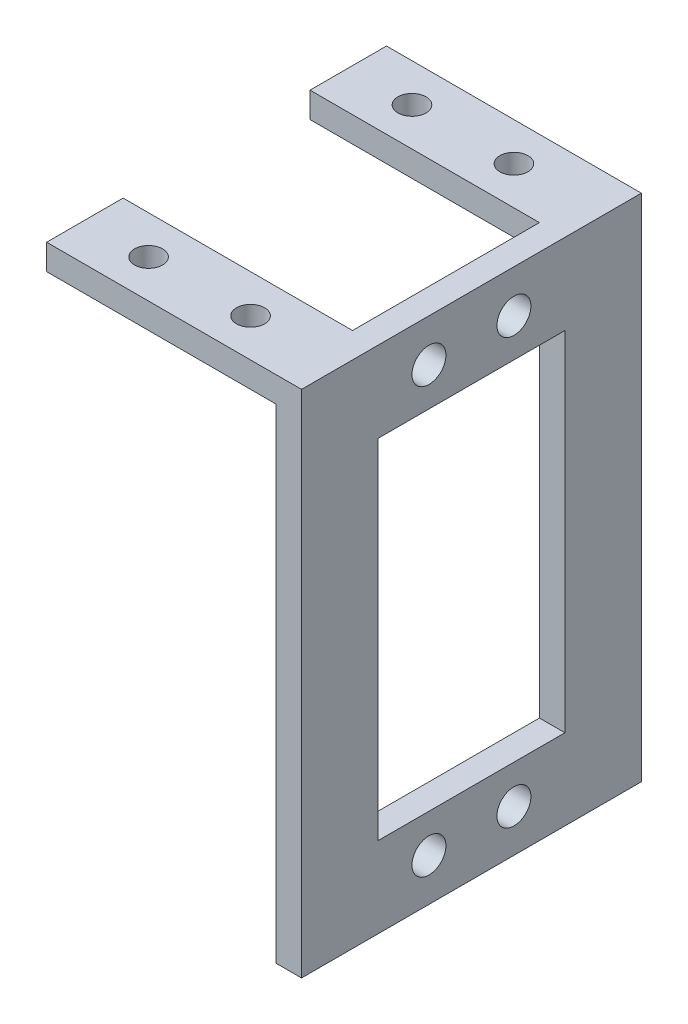
ISO-10303-21;
HEADER;
FILE_DESCRIPTION(('STEP AP214'),'2;1');
FILE_NAME('part.step','',(''),(''),'','','');
FILE_SCHEMA(('AUTOMOTIVE_DESIGN { 1 0 10303 214 1 1 1 1 }'));
ENDSEC;
DATA;
#1=APPLICATION_CONTEXT('core data for automotive mechanical design processes');
#2=APPLICATION_PROTOCOL_DEFINITION('international standard','automotive_design',2000,#1);
#3=PRODUCT_CONTEXT('',#1,'mechanical');
#4=PRODUCT('Part','Part','',(#3));
#5=PRODUCT_RELATED_PRODUCT_CATEGORY('part','',(#4));
#6=PRODUCT_DEFINITION_FORMATION('','',#4);
#7=PRODUCT_DEFINITION_CONTEXT('part definition',#1,'design');
#8=PRODUCT_DEFINITION('design','',#6,#7);
#9=PRODUCT_DEFINITION_SHAPE('','',#8);
#10=(LENGTH_UNIT() NAMED_UNIT(*) SI_UNIT(.MILLI.,.METRE.));
#11=(NAMED_UNIT(*) PLANE_ANGLE_UNIT() SI_UNIT($,.RADIAN.));
#12=(NAMED_UNIT(*) SI_UNIT($,.STERADIAN.) SOLID_ANGLE_UNIT());
#13=UNCERTAINTY_MEASURE_WITH_UNIT(LENGTH_MEASURE(1.E-05),#10,'distance_accuracy_value','');
#14=(GEOMETRIC_REPRESENTATION_CONTEXT(3) GLOBAL_UNCERTAINTY_ASSIGNED_CONTEXT((#13)) GLOBAL_UNIT_ASSIGNED_CONTEXT((#10,
#11,#12)) REPRESENTATION_CONTEXT('',''));
#15=CARTESIAN_POINT('',(0.,0.,0.));
#16=DIRECTION('',(0.,0.,1.));
#17=DIRECTION('',(1.,0.,0.));
#18=AXIS2_PLACEMENT_3D('',#15,#16,#17);
#19=CARTESIAN_POINT('',(0.,0.,40.));
#20=DIRECTION('',(1.,0.,0.));
#21=DIRECTION('',(0.,0.,-1.));
#22=AXIS2_PLACEMENT_3D('',#19,#20,#21);
#23=PLANE('',#22);
#24=DIRECTION('',(0.,0.,-1.));
#25=VECTOR('',#24,1.);
#26=CARTESIAN_POINT('',(0.,-3.,40.));
#27=LINE('',#26,#25);
#28=CARTESIAN_POINT('',(0.,-3.,9.));
#29=VERTEX_POINT('',#28);
#30=CARTESIAN_POINT('',(0.,-3.,0.));
#31=VERTEX_POINT('',#30);
#32=EDGE_CURVE('E46',#29,#31,#27,.T.);
#33=ORIENTED_EDGE('',*,*,#32,.F.);
#34=DIRECTION('',(0.,1.,0.));
#35=VECTOR('',#34,1.);
#36=CARTESIAN_POINT('',(0.,-10.,9.));
#37=LINE('',#36,#35);
#38=CARTESIAN_POINT('',(0.,0.,9.));
#39=VERTEX_POINT('',#38);
#40=EDGE_CURVE('E219',#29,#39,#37,.T.);
#41=ORIENTED_EDGE('',*,*,#40,.T.);
#42=DIRECTION('',(0.,0.,-1.));
#43=VECTOR('',#42,1.);
#44=CARTESIAN_POINT('',(0.,0.,40.));
#45=LINE('',#44,#43);
#46=CARTESIAN_POINT('',(0.,0.,0.));
#47=VERTEX_POINT('',#46);
#48=EDGE_CURVE('E260',#39,#47,#45,.T.);
#49=ORIENTED_EDGE('',*,*,#48,.T.);
#50=DIRECTION('',(0.,-1.,0.));
#51=VECTOR('',#50,1.);
#52=CARTESIAN_POINT('',(0.,0.,0.));
#53=LINE('',#52,#51);
#54=EDGE_CURVE('E245',#47,#31,#53,.T.);
#55=ORIENTED_EDGE('',*,*,#54,.T.);
#56=EDGE_LOOP('',(#33,#41,#49,#55));
#57=FACE_BOUND('',#56,.T.);
#58=ADVANCED_FACE('F38',(#57),#23,.F.);
#59=CARTESIAN_POINT('',(0.,-3.,40.));
#60=DIRECTION('',(0.,1.,0.));
#61=DIRECTION('',(0.,0.,1.));
#62=AXIS2_PLACEMENT_3D('',#59,#60,#61);
#63=PLANE('',#62);
#64=CARTESIAN_POINT('',(19.5,-3.,4.5));
#65=DIRECTION('',(0.,1.,0.));
#66=DIRECTION('',(0.,0.,1.));
#67=AXIS2_PLACEMENT_3D('',#64,#65,#66);
#68=CIRCLE('',#67,1.65);
#69=CARTESIAN_POINT('',(19.5,-3.,6.15));
#70=VERTEX_POINT('',#69);
#71=EDGE_CURVE('E236',#70,#70,#68,.T.);
#72=ORIENTED_EDGE('',*,*,#71,.T.);
#73=EDGE_LOOP('',(#72));
#74=FACE_BOUND('',#73,.T.);
#75=CARTESIAN_POINT('',(7.5,-3.,4.5));
#76=DIRECTION('',(0.,1.,0.));
#77=DIRECTION('',(0.,0.,1.));
#78=AXIS2_PLACEMENT_3D('',#75,#76,#77);
#79=CIRCLE('',#78,1.65);
#80=CARTESIAN_POINT('',(7.5,-3.,6.15));
#81=VERTEX_POINT('',#80);
#82=EDGE_CURVE('E233',#81,#81,#79,.T.);
#83=ORIENTED_EDGE('',*,*,#82,.T.);
#84=EDGE_LOOP('',(#83));
#85=FACE_BOUND('',#84,.T.);
#86=DIRECTION('',(0.,0.,-1.));
#87=VECTOR('',#86,1.);
#88=CARTESIAN_POINT('',(27.,-3.,40.));
#89=LINE('',#88,#87);
#90=CARTESIAN_POINT('',(27.,-3.,9.));
#91=VERTEX_POINT('',#90);
#92=CARTESIAN_POINT('',(27.,-3.,0.));
#93=VERTEX_POINT('',#92);
#94=EDGE_CURVE('E285',#91,#93,#89,.T.);
#95=ORIENTED_EDGE('',*,*,#94,.F.);
#96=DIRECTION('',(-1.,0.,0.));
#97=VECTOR('',#96,1.);
#98=CARTESIAN_POINT('',(0.,-3.,9.));
#99=LINE('',#98,#97);
#100=EDGE_CURVE('E230',#91,#29,#99,.T.);
#101=ORIENTED_EDGE('',*,*,#100,.T.);
#102=ORIENTED_EDGE('',*,*,#32,.T.);
#103=DIRECTION('',(1.,0.,0.));
#104=VECTOR('',#103,1.);
#105=CARTESIAN_POINT('',(0.,-3.,0.));
#106=LINE('',#105,#104);
#107=EDGE_CURVE('E263',#31,#93,#106,.T.);
#108=ORIENTED_EDGE('',*,*,#107,.T.);
#109=EDGE_LOOP('',(#95,#101,#102,#108));
#110=FACE_BOUND('',#109,.T.);
#111=ADVANCED_FACE('F298',(#74,#85,#110),#63,.F.);
#112=CARTESIAN_POINT('',(0.,0.,40.));
#113=VERTEX_POINT('',#112);
#114=CARTESIAN_POINT('',(0.,0.,31.));
#115=VERTEX_POINT('',#114);
#116=EDGE_CURVE('E274',#113,#115,#45,.T.);
#117=ORIENTED_EDGE('',*,*,#116,.T.);
#118=DIRECTION('',(0.,1.,0.));
#119=VECTOR('',#118,1.);
#120=CARTESIAN_POINT('',(0.,-10.,31.));
#121=LINE('',#120,#119);
#122=CARTESIAN_POINT('',(0.,-3.,31.));
#123=VERTEX_POINT('',#122);
#124=EDGE_CURVE('E218',#123,#115,#121,.T.);
#125=ORIENTED_EDGE('',*,*,#124,.F.);
#126=CARTESIAN_POINT('',(0.,-3.,40.));
#127=VERTEX_POINT('',#126);
#128=EDGE_CURVE('E11',#127,#123,#27,.T.);
#129=ORIENTED_EDGE('',*,*,#128,.F.);
#130=DIRECTION('',(0.,-1.,0.));
#131=VECTOR('',#130,1.);
#132=CARTESIAN_POINT('',(0.,0.,40.));
#133=LINE('',#132,#131);
#134=EDGE_CURVE('E246',#113,#127,#133,.T.);
#135=ORIENTED_EDGE('',*,*,#134,.F.);
#136=EDGE_LOOP('',(#117,#125,#129,#135));
#137=FACE_BOUND('',#136,.T.);
#138=ADVANCED_FACE('F40',(#137),#23,.F.);
#139=CARTESIAN_POINT('',(7.5,-3.,35.5));
#140=DIRECTION('',(0.,1.,0.));
#141=DIRECTION('',(0.,0.,1.));
#142=AXIS2_PLACEMENT_3D('',#139,#140,#141);
#143=CIRCLE('',#142,1.65);
#144=CARTESIAN_POINT('',(7.5,-3.,37.15));
#145=VERTEX_POINT('',#144);
#146=EDGE_CURVE('E242',#145,#145,#143,.T.);
#147=ORIENTED_EDGE('',*,*,#146,.T.);
#148=EDGE_LOOP('',(#147));
#149=FACE_BOUND('',#148,.T.);
#150=CARTESIAN_POINT('',(19.5,-3.,35.5));
#151=DIRECTION('',(0.,1.,0.));
#152=DIRECTION('',(0.,0.,1.));
#153=AXIS2_PLACEMENT_3D('',#150,#151,#152);
#154=CIRCLE('',#153,1.65);
#155=CARTESIAN_POINT('',(19.5,-3.,37.15));
#156=VERTEX_POINT('',#155);
#157=EDGE_CURVE('E239',#156,#156,#154,.T.);
#158=ORIENTED_EDGE('',*,*,#157,.T.);
#159=EDGE_LOOP('',(#158));
#160=FACE_BOUND('',#159,.T.);
#161=ORIENTED_EDGE('',*,*,#128,.T.);
#162=DIRECTION('',(1.,0.,0.));
#163=VECTOR('',#162,1.);
#164=CARTESIAN_POINT('',(0.,-3.,31.));
#165=LINE('',#164,#163);
#166=CARTESIAN_POINT('',(27.,-3.,31.));
#167=VERTEX_POINT('',#166);
#168=EDGE_CURVE('E222',#123,#167,#165,.T.);
#169=ORIENTED_EDGE('',*,*,#168,.T.);
#170=CARTESIAN_POINT('',(27.,-3.,40.));
#171=VERTEX_POINT('',#170);
#172=EDGE_CURVE('E286',#171,#167,#89,.T.);
#173=ORIENTED_EDGE('',*,*,#172,.F.);
#174=DIRECTION('',(1.,0.,0.));
#175=VECTOR('',#174,1.);
#176=CARTESIAN_POINT('',(0.,-3.,40.));
#177=LINE('',#176,#175);
#178=EDGE_CURVE('E249',#127,#171,#177,.T.);
#179=ORIENTED_EDGE('',*,*,#178,.F.);
#180=EDGE_LOOP('',(#161,#169,#173,#179));
#181=FACE_BOUND('',#180,.T.);
#182=ADVANCED_FACE('F320',(#149,#160,#181),#63,.F.);
#183=CARTESIAN_POINT('',(27.,-3.,40.));
#184=DIRECTION('',(1.,0.,0.));
#185=DIRECTION('',(0.,1.,0.));
#186=AXIS2_PLACEMENT_3D('',#183,#184,#185);
#187=PLANE('',#186);
#188=CARTESIAN_POINT('',(27.,-5.,15.));
#189=DIRECTION('',(1.,0.,0.));
#190=DIRECTION('',(0.,1.,0.));
#191=AXIS2_PLACEMENT_3D('',#188,#189,#190);
#192=CIRCLE('',#191,2.);
#193=CARTESIAN_POINT('',(27.,-3.,15.));
#194=VERTEX_POINT('',#193);
#195=EDGE_CURVE('E195',#194,#194,#192,.T.);
#196=ORIENTED_EDGE('',*,*,#195,.T.);
#197=EDGE_LOOP('',(#196));
#198=FACE_BOUND('',#197,.T.);
#199=CARTESIAN_POINT('',(27.,-55.,15.));
#200=DIRECTION('',(1.,0.,0.));
#201=DIRECTION('',(0.,1.,0.));
#202=AXIS2_PLACEMENT_3D('',#199,#200,#201);
#203=CIRCLE('',#202,2.);
#204=CARTESIAN_POINT('',(27.,-53.,15.));
#205=VERTEX_POINT('',#204);
#206=EDGE_CURVE('E192',#205,#205,#203,.T.);
#207=ORIENTED_EDGE('',*,*,#206,.T.);
#208=EDGE_LOOP('',(#207));
#209=FACE_BOUND('',#208,.T.);
#210=CARTESIAN_POINT('',(27.,-55.,25.));
#211=DIRECTION('',(1.,0.,0.));
#212=DIRECTION('',(0.,1.,0.));
#213=AXIS2_PLACEMENT_3D('',#210,#211,#212);
#214=CIRCLE('',#213,2.);
#215=CARTESIAN_POINT('',(27.,-53.,25.));
#216=VERTEX_POINT('',#215);
#217=EDGE_CURVE('E189',#216,#216,#214,.T.);
#218=ORIENTED_EDGE('',*,*,#217,.T.);
#219=EDGE_LOOP('',(#218));
#220=FACE_BOUND('',#219,.T.);
#221=DIRECTION('',(0.,0.,-1.));
#222=VECTOR('',#221,1.);
#223=CARTESIAN_POINT('',(27.,-50.5,40.));
#224=LINE('',#223,#222);
#225=CARTESIAN_POINT('',(27.,-50.5,31.));
#226=VERTEX_POINT('',#225);
#227=CARTESIAN_POINT('',(27.,-50.5,8.99999999999999));
#228=VERTEX_POINT('',#227);
#229=EDGE_CURVE('E183',#226,#228,#224,.T.);
#230=ORIENTED_EDGE('',*,*,#229,.T.);
#231=DIRECTION('',(0.,1.,0.));
#232=VECTOR('',#231,1.);
#233=CARTESIAN_POINT('',(27.,-3.,8.99999999999999));
#234=LINE('',#233,#232);
#235=CARTESIAN_POINT('',(27.,-9.50000000000001,8.99999999999999));
#236=VERTEX_POINT('',#235);
#237=EDGE_CURVE('E186',#228,#236,#234,.T.);
#238=ORIENTED_EDGE('',*,*,#237,.T.);
#239=DIRECTION('',(0.,0.,1.));
#240=VECTOR('',#239,1.);
#241=CARTESIAN_POINT('',(27.,-9.50000000000001,40.));
#242=LINE('',#241,#240);
#243=CARTESIAN_POINT('',(27.,-9.50000000000001,31.));
#244=VERTEX_POINT('',#243);
#245=EDGE_CURVE('E180',#236,#244,#242,.T.);
#246=ORIENTED_EDGE('',*,*,#245,.T.);
#247=DIRECTION('',(0.,-1.,0.));
#248=VECTOR('',#247,1.);
#249=CARTESIAN_POINT('',(27.,-3.,31.));
#250=LINE('',#249,#248);
#251=EDGE_CURVE('E145',#244,#226,#250,.T.);
#252=ORIENTED_EDGE('',*,*,#251,.T.);
#253=EDGE_LOOP('',(#230,#238,#246,#252));
#254=FACE_BOUND('',#253,.T.);
#255=CARTESIAN_POINT('',(27.,-5.,25.));
#256=DIRECTION('',(1.,0.,0.));
#257=DIRECTION('',(0.,1.,0.));
#258=AXIS2_PLACEMENT_3D('',#255,#256,#257);
#259=CIRCLE('',#258,2.);
#260=CARTESIAN_POINT('',(27.,-3.,25.));
#261=VERTEX_POINT('',#260);
#262=EDGE_CURVE('E177',#261,#261,#259,.T.);
#263=ORIENTED_EDGE('',*,*,#262,.T.);
#264=EDGE_LOOP('',(#263));
#265=FACE_BOUND('',#264,.T.);
#266=ORIENTED_EDGE('',*,*,#172,.T.);
#267=DIRECTION('',(0.,1.,0.));
#268=VECTOR('',#267,1.);
#269=CARTESIAN_POINT('',(27.,-10.,31.));
#270=LINE('',#269,#268);
#271=CARTESIAN_POINT('',(27.,0.,31.));
#272=VERTEX_POINT('',#271);
#273=EDGE_CURVE('E225',#167,#272,#270,.T.);
#274=ORIENTED_EDGE('',*,*,#273,.T.);
#275=DIRECTION('',(0.,0.,-1.));
#276=VECTOR('',#275,1.);
#277=CARTESIAN_POINT('',(27.,0.,9.));
#278=LINE('',#277,#276);
#279=CARTESIAN_POINT('',(27.,0.,9.));
#280=VERTEX_POINT('',#279);
#281=EDGE_CURVE('E213',#272,#280,#278,.T.);
#282=ORIENTED_EDGE('',*,*,#281,.T.);
#283=DIRECTION('',(0.,1.,0.));
#284=VECTOR('',#283,1.);
#285=CARTESIAN_POINT('',(27.,-10.,9.));
#286=LINE('',#285,#284);
#287=EDGE_CURVE('E223',#91,#280,#286,.T.);
#288=ORIENTED_EDGE('',*,*,#287,.F.);
#289=ORIENTED_EDGE('',*,*,#94,.T.);
#290=DIRECTION('',(0.,-1.,0.));
#291=VECTOR('',#290,1.);
#292=CARTESIAN_POINT('',(27.,-3.,0.));
#293=LINE('',#292,#291);
#294=CARTESIAN_POINT('',(27.,-60.,0.));
#295=VERTEX_POINT('',#294);
#296=EDGE_CURVE('E266',#93,#295,#293,.T.);
#297=ORIENTED_EDGE('',*,*,#296,.T.);
#298=DIRECTION('',(0.,0.,-1.));
#299=VECTOR('',#298,1.);
#300=CARTESIAN_POINT('',(27.,-60.,40.));
#301=LINE('',#300,#299);
#302=CARTESIAN_POINT('',(27.,-60.,40.));
#303=VERTEX_POINT('',#302);
#304=EDGE_CURVE('E283',#303,#295,#301,.T.);
#305=ORIENTED_EDGE('',*,*,#304,.F.);
#306=DIRECTION('',(0.,-1.,0.));
#307=VECTOR('',#306,1.);
#308=CARTESIAN_POINT('',(27.,-3.,40.));
#309=LINE('',#308,#307);
#310=EDGE_CURVE('E252',#171,#303,#309,.T.);
#311=ORIENTED_EDGE('',*,*,#310,.F.);
#312=EDGE_LOOP('',(#266,#274,#282,#288,#289,#297,#305,#311));
#313=FACE_BOUND('',#312,.T.);
#314=ADVANCED_FACE('F293',(#198,#209,#220,#254,#265,#313),#187,.F.);
#315=CARTESIAN_POINT('',(27.,-60.,40.));
#316=DIRECTION('',(0.,1.,0.));
#317=DIRECTION('',(0.,0.,1.));
#318=AXIS2_PLACEMENT_3D('',#315,#316,#317);
#319=PLANE('',#318);
#320=DIRECTION('',(1.,0.,0.));
#321=VECTOR('',#320,1.);
#322=CARTESIAN_POINT('',(27.,-60.,0.));
#323=LINE('',#322,#321);
#324=CARTESIAN_POINT('',(30.,-60.,0.));
#325=VERTEX_POINT('',#324);
#326=EDGE_CURVE('E268',#295,#325,#323,.T.);
#327=ORIENTED_EDGE('',*,*,#326,.T.);
#328=DIRECTION('',(0.,0.,-1.));
#329=VECTOR('',#328,1.);
#330=CARTESIAN_POINT('',(30.,-60.,40.));
#331=LINE('',#330,#329);
#332=CARTESIAN_POINT('',(30.,-60.,40.));
#333=VERTEX_POINT('',#332);
#334=EDGE_CURVE('E280',#333,#325,#331,.T.);
#335=ORIENTED_EDGE('',*,*,#334,.F.);
#336=DIRECTION('',(1.,0.,0.));
#337=VECTOR('',#336,1.);
#338=CARTESIAN_POINT('',(27.,-60.,40.));
#339=LINE('',#338,#337);
#340=EDGE_CURVE('E254',#303,#333,#339,.T.);
#341=ORIENTED_EDGE('',*,*,#340,.F.);
#342=ORIENTED_EDGE('',*,*,#304,.T.);
#343=EDGE_LOOP('',(#327,#335,#341,#342));
#344=FACE_BOUND('',#343,.T.);
#345=ADVANCED_FACE('F308',(#344),#319,.F.);
#346=CARTESIAN_POINT('',(30.,0.,40.));
#347=DIRECTION('',(-1.,0.,0.));
#348=DIRECTION('',(0.,-1.,0.));
#349=AXIS2_PLACEMENT_3D('',#346,#347,#348);
#350=PLANE('',#349);
#351=CARTESIAN_POINT('',(30.,-5.,15.));
#352=DIRECTION('',(1.,0.,0.));
#353=DIRECTION('',(0.,1.,0.));
#354=AXIS2_PLACEMENT_3D('',#351,#352,#353);
#355=CIRCLE('',#354,2.);
#356=CARTESIAN_POINT('',(30.,-3.,15.));
#357=VERTEX_POINT('',#356);
#358=EDGE_CURVE('E168',#357,#357,#355,.T.);
#359=ORIENTED_EDGE('',*,*,#358,.F.);
#360=EDGE_LOOP('',(#359));
#361=FACE_BOUND('',#360,.T.);
#362=CARTESIAN_POINT('',(30.,-55.,15.));
#363=DIRECTION('',(1.,0.,0.));
#364=DIRECTION('',(0.,1.,0.));
#365=AXIS2_PLACEMENT_3D('',#362,#363,#364);
#366=CIRCLE('',#365,2.);
#367=CARTESIAN_POINT('',(30.,-53.,15.));
#368=VERTEX_POINT('',#367);
#369=EDGE_CURVE('E172',#368,#368,#366,.T.);
#370=ORIENTED_EDGE('',*,*,#369,.F.);
#371=EDGE_LOOP('',(#370));
#372=FACE_BOUND('',#371,.T.);
#373=CARTESIAN_POINT('',(30.,-55.,25.));
#374=DIRECTION('',(1.,0.,0.));
#375=DIRECTION('',(0.,-1.,0.));
#376=AXIS2_PLACEMENT_3D('',#373,#374,#375);
#377=CIRCLE('',#376,2.);
#378=CARTESIAN_POINT('',(30.,-57.,25.));
#379=VERTEX_POINT('',#378);
#380=EDGE_CURVE('E165',#379,#379,#377,.T.);
#381=ORIENTED_EDGE('',*,*,#380,.F.);
#382=EDGE_LOOP('',(#381));
#383=FACE_BOUND('',#382,.T.);
#384=DIRECTION('',(0.,0.,1.));
#385=VECTOR('',#384,1.);
#386=CARTESIAN_POINT('',(30.,-9.50000000000001,31.));
#387=LINE('',#386,#385);
#388=CARTESIAN_POINT('',(30.,-9.50000000000001,8.99999999999999));
#389=VERTEX_POINT('',#388);
#390=CARTESIAN_POINT('',(30.,-9.50000000000001,31.));
#391=VERTEX_POINT('',#390);
#392=EDGE_CURVE('E151',#389,#391,#387,.T.);
#393=ORIENTED_EDGE('',*,*,#392,.F.);
#394=DIRECTION('',(0.,1.,0.));
#395=VECTOR('',#394,1.);
#396=CARTESIAN_POINT('',(30.,-50.5,8.99999999999999));
#397=LINE('',#396,#395);
#398=CARTESIAN_POINT('',(30.,-50.5,8.99999999999999));
#399=VERTEX_POINT('',#398);
#400=EDGE_CURVE('E61',#399,#389,#397,.T.);
#401=ORIENTED_EDGE('',*,*,#400,.F.);
#402=DIRECTION('',(0.,0.,-1.));
#403=VECTOR('',#402,1.);
#404=CARTESIAN_POINT('',(30.,-50.5,31.));
#405=LINE('',#404,#403);
#406=CARTESIAN_POINT('',(30.,-50.5,31.));
#407=VERTEX_POINT('',#406);
#408=EDGE_CURVE('E158',#407,#399,#405,.T.);
#409=ORIENTED_EDGE('',*,*,#408,.F.);
#410=DIRECTION('',(0.,-1.,0.));
#411=VECTOR('',#410,1.);
#412=CARTESIAN_POINT('',(30.,-50.5,31.));
#413=LINE('',#412,#411);
#414=EDGE_CURVE('E142',#391,#407,#413,.T.);
#415=ORIENTED_EDGE('',*,*,#414,.F.);
#416=EDGE_LOOP('',(#393,#401,#409,#415));
#417=FACE_BOUND('',#416,.T.);
#418=CARTESIAN_POINT('',(30.,-5.,25.));
#419=DIRECTION('',(1.,0.,0.));
#420=DIRECTION('',(0.,1.,0.));
#421=AXIS2_PLACEMENT_3D('',#418,#419,#420);
#422=CIRCLE('',#421,2.);
#423=CARTESIAN_POINT('',(30.,-3.,25.));
#424=VERTEX_POINT('',#423);
#425=EDGE_CURVE('E171',#424,#424,#422,.T.);
#426=ORIENTED_EDGE('',*,*,#425,.F.);
#427=EDGE_LOOP('',(#426));
#428=FACE_BOUND('',#427,.T.);
#429=DIRECTION('',(0.,1.,0.));
#430=VECTOR('',#429,1.);
#431=CARTESIAN_POINT('',(30.,0.,0.));
#432=LINE('',#431,#430);
#433=CARTESIAN_POINT('',(30.,0.,0.));
#434=VERTEX_POINT('',#433);
#435=EDGE_CURVE('E270',#325,#434,#432,.T.);
#436=ORIENTED_EDGE('',*,*,#435,.T.);
#437=DIRECTION('',(0.,0.,-1.));
#438=VECTOR('',#437,1.);
#439=CARTESIAN_POINT('',(30.,0.,40.));
#440=LINE('',#439,#438);
#441=CARTESIAN_POINT('',(30.,0.,40.));
#442=VERTEX_POINT('',#441);
#443=EDGE_CURVE('E277',#442,#434,#440,.T.);
#444=ORIENTED_EDGE('',*,*,#443,.F.);
#445=DIRECTION('',(0.,1.,0.));
#446=VECTOR('',#445,1.);
#447=CARTESIAN_POINT('',(30.,0.,40.));
#448=LINE('',#447,#446);
#449=EDGE_CURVE('E256',#333,#442,#448,.T.);
#450=ORIENTED_EDGE('',*,*,#449,.F.);
#451=ORIENTED_EDGE('',*,*,#334,.T.);
#452=EDGE_LOOP('',(#436,#444,#450,#451));
#453=FACE_BOUND('',#452,.T.);
#454=ADVANCED_FACE('F155',(#361,#372,#383,#417,#428,#453),#350,.F.);
#455=CARTESIAN_POINT('',(0.,0.,40.));
#456=DIRECTION('',(0.,-1.,0.));
#457=DIRECTION('',(0.,0.,-1.));
#458=AXIS2_PLACEMENT_3D('',#455,#456,#457);
#459=PLANE('',#458);
#460=CARTESIAN_POINT('',(7.5,0.,35.5));
#461=DIRECTION('',(0.,1.,0.));
#462=DIRECTION('',(0.,0.,-1.));
#463=AXIS2_PLACEMENT_3D('',#460,#461,#462);
#464=CIRCLE('',#463,1.65);
#465=CARTESIAN_POINT('',(7.5,0.,33.85));
#466=VERTEX_POINT('',#465);
#467=EDGE_CURVE('E198',#466,#466,#464,.T.);
#468=ORIENTED_EDGE('',*,*,#467,.F.);
#469=EDGE_LOOP('',(#468));
#470=FACE_BOUND('',#469,.T.);
#471=CARTESIAN_POINT('',(19.5,0.,35.5));
#472=DIRECTION('',(0.,1.,0.));
#473=DIRECTION('',(0.,0.,-1.));
#474=AXIS2_PLACEMENT_3D('',#471,#472,#473);
#475=CIRCLE('',#474,1.65);
#476=CARTESIAN_POINT('',(19.5,0.,33.85));
#477=VERTEX_POINT('',#476);
#478=EDGE_CURVE('E206',#477,#477,#475,.T.);
#479=ORIENTED_EDGE('',*,*,#478,.F.);
#480=EDGE_LOOP('',(#479));
#481=FACE_BOUND('',#480,.T.);
#482=CARTESIAN_POINT('',(19.5,0.,4.5));
#483=DIRECTION('',(0.,1.,0.));
#484=DIRECTION('',(0.,0.,1.));
#485=AXIS2_PLACEMENT_3D('',#482,#483,#484);
#486=CIRCLE('',#485,1.65);
#487=CARTESIAN_POINT('',(19.5,0.,6.15));
#488=VERTEX_POINT('',#487);
#489=EDGE_CURVE('E203',#488,#488,#486,.T.);
#490=ORIENTED_EDGE('',*,*,#489,.F.);
#491=EDGE_LOOP('',(#490));
#492=FACE_BOUND('',#491,.T.);
#493=CARTESIAN_POINT('',(7.5,0.,4.5));
#494=DIRECTION('',(0.,1.,0.));
#495=DIRECTION('',(0.,0.,1.));
#496=AXIS2_PLACEMENT_3D('',#493,#494,#495);
#497=CIRCLE('',#496,1.65);
#498=CARTESIAN_POINT('',(7.5,0.,6.15));
#499=VERTEX_POINT('',#498);
#500=EDGE_CURVE('E199',#499,#499,#497,.T.);
#501=ORIENTED_EDGE('',*,*,#500,.F.);
#502=EDGE_LOOP('',(#501));
#503=FACE_BOUND('',#502,.T.);
#504=ORIENTED_EDGE('',*,*,#48,.F.);
#505=DIRECTION('',(-1.,0.,0.));
#506=VECTOR('',#505,1.);
#507=CARTESIAN_POINT('',(0.,0.,9.));
#508=LINE('',#507,#506);
#509=EDGE_CURVE('E216',#280,#39,#508,.T.);
#510=ORIENTED_EDGE('',*,*,#509,.F.);
#511=ORIENTED_EDGE('',*,*,#281,.F.);
#512=DIRECTION('',(1.,0.,0.));
#513=VECTOR('',#512,1.);
#514=CARTESIAN_POINT('',(0.,0.,31.));
#515=LINE('',#514,#513);
#516=EDGE_CURVE('E202',#115,#272,#515,.T.);
#517=ORIENTED_EDGE('',*,*,#516,.F.);
#518=ORIENTED_EDGE('',*,*,#116,.F.);
#519=DIRECTION('',(-1.,0.,0.));
#520=VECTOR('',#519,1.);
#521=CARTESIAN_POINT('',(0.,0.,40.));
#522=LINE('',#521,#520);
#523=EDGE_CURVE('E258',#442,#113,#522,.T.);
#524=ORIENTED_EDGE('',*,*,#523,.F.);
#525=ORIENTED_EDGE('',*,*,#443,.T.);
#526=DIRECTION('',(-1.,0.,0.));
#527=VECTOR('',#526,1.);
#528=CARTESIAN_POINT('',(0.,0.,0.));
#529=LINE('',#528,#527);
#530=EDGE_CURVE('E250',#434,#47,#529,.T.);
#531=ORIENTED_EDGE('',*,*,#530,.T.);
#532=EDGE_LOOP('',(#504,#510,#511,#517,#518,#524,#525,#531));
#533=FACE_BOUND('',#532,.T.);
#534=ADVANCED_FACE('F328',(#470,#481,#492,#503,#533),#459,.F.);
#535=CARTESIAN_POINT('',(0.,0.,40.));
#536=DIRECTION('',(0.,0.,1.));
#537=DIRECTION('',(1.,0.,0.));
#538=AXIS2_PLACEMENT_3D('',#535,#536,#537);
#539=PLANE('',#538);
#540=ORIENTED_EDGE('',*,*,#134,.T.);
#541=ORIENTED_EDGE('',*,*,#178,.T.);
#542=ORIENTED_EDGE('',*,*,#310,.T.);
#543=ORIENTED_EDGE('',*,*,#340,.T.);
#544=ORIENTED_EDGE('',*,*,#449,.T.);
#545=ORIENTED_EDGE('',*,*,#523,.T.);
#546=EDGE_LOOP('',(#540,#541,#542,#543,#544,#545));
#547=FACE_BOUND('',#546,.T.);
#548=ADVANCED_FACE('F315',(#547),#539,.T.);
#549=CARTESIAN_POINT('',(0.,0.,0.));
#550=DIRECTION('',(0.,0.,1.));
#551=DIRECTION('',(1.,0.,0.));
#552=AXIS2_PLACEMENT_3D('',#549,#550,#551);
#553=PLANE('',#552);
#554=ORIENTED_EDGE('',*,*,#54,.F.);
#555=ORIENTED_EDGE('',*,*,#530,.F.);
#556=ORIENTED_EDGE('',*,*,#435,.F.);
#557=ORIENTED_EDGE('',*,*,#326,.F.);
#558=ORIENTED_EDGE('',*,*,#296,.F.);
#559=ORIENTED_EDGE('',*,*,#107,.F.);
#560=EDGE_LOOP('',(#554,#555,#556,#557,#558,#559));
#561=FACE_BOUND('',#560,.T.);
#562=ADVANCED_FACE('F303',(#561),#553,.F.);
#563=CARTESIAN_POINT('',(0.,-10.,9.));
#564=DIRECTION('',(0.,0.,-1.));
#565=DIRECTION('',(-1.,0.,0.));
#566=AXIS2_PLACEMENT_3D('',#563,#564,#565);
#567=PLANE('',#566);
#568=ORIENTED_EDGE('',*,*,#287,.T.);
#569=ORIENTED_EDGE('',*,*,#509,.T.);
#570=ORIENTED_EDGE('',*,*,#40,.F.);
#571=ORIENTED_EDGE('',*,*,#100,.F.);
#572=EDGE_LOOP('',(#568,#569,#570,#571));
#573=FACE_BOUND('',#572,.T.);
#574=ADVANCED_FACE('F332',(#573),#567,.F.);
#575=CARTESIAN_POINT('',(0.,-10.,31.));
#576=DIRECTION('',(0.,0.,1.));
#577=DIRECTION('',(1.,0.,0.));
#578=AXIS2_PLACEMENT_3D('',#575,#576,#577);
#579=PLANE('',#578);
#580=ORIENTED_EDGE('',*,*,#124,.T.);
#581=ORIENTED_EDGE('',*,*,#516,.T.);
#582=ORIENTED_EDGE('',*,*,#273,.F.);
#583=ORIENTED_EDGE('',*,*,#168,.F.);
#584=EDGE_LOOP('',(#580,#581,#582,#583));
#585=FACE_BOUND('',#584,.T.);
#586=ADVANCED_FACE('F323',(#585),#579,.F.);
#587=CARTESIAN_POINT('',(7.5,-10.,4.5));
#588=DIRECTION('',(0.,1.,0.));
#589=DIRECTION('',(0.,0.,1.));
#590=AXIS2_PLACEMENT_3D('',#587,#588,#589);
#591=CYLINDRICAL_SURFACE('',#590,1.65);
#592=ORIENTED_EDGE('',*,*,#500,.T.);
#593=EDGE_LOOP('',(#592));
#594=FACE_BOUND('',#593,.T.);
#595=ORIENTED_EDGE('',*,*,#82,.F.);
#596=EDGE_LOOP('',(#595));
#597=FACE_BOUND('',#596,.T.);
#598=ADVANCED_FACE('F365',(#594,#597),#591,.F.);
#599=CARTESIAN_POINT('',(19.5,-10.,4.5));
#600=DIRECTION('',(0.,1.,0.));
#601=DIRECTION('',(0.,0.,1.));
#602=AXIS2_PLACEMENT_3D('',#599,#600,#601);
#603=CYLINDRICAL_SURFACE('',#602,1.65);
#604=ORIENTED_EDGE('',*,*,#489,.T.);
#605=EDGE_LOOP('',(#604));
#606=FACE_BOUND('',#605,.T.);
#607=ORIENTED_EDGE('',*,*,#71,.F.);
#608=EDGE_LOOP('',(#607));
#609=FACE_BOUND('',#608,.T.);
#610=ADVANCED_FACE('F376',(#606,#609),#603,.F.);
#611=CARTESIAN_POINT('',(19.5,-10.,35.5));
#612=DIRECTION('',(0.,1.,0.));
#613=DIRECTION('',(0.,0.,1.));
#614=AXIS2_PLACEMENT_3D('',#611,#612,#613);
#615=CYLINDRICAL_SURFACE('',#614,1.65);
#616=ORIENTED_EDGE('',*,*,#478,.T.);
#617=EDGE_LOOP('',(#616));
#618=FACE_BOUND('',#617,.T.);
#619=ORIENTED_EDGE('',*,*,#157,.F.);
#620=EDGE_LOOP('',(#619));
#621=FACE_BOUND('',#620,.T.);
#622=ADVANCED_FACE('F372',(#618,#621),#615,.F.);
#623=CARTESIAN_POINT('',(7.5,-10.,35.5));
#624=DIRECTION('',(0.,1.,0.));
#625=DIRECTION('',(0.,0.,1.));
#626=AXIS2_PLACEMENT_3D('',#623,#624,#625);
#627=CYLINDRICAL_SURFACE('',#626,1.65);
#628=ORIENTED_EDGE('',*,*,#467,.T.);
#629=EDGE_LOOP('',(#628));
#630=FACE_BOUND('',#629,.T.);
#631=ORIENTED_EDGE('',*,*,#146,.F.);
#632=EDGE_LOOP('',(#631));
#633=FACE_BOUND('',#632,.T.);
#634=ADVANCED_FACE('F368',(#630,#633),#627,.F.);
#635=CARTESIAN_POINT('',(20.,-5.,25.));
#636=DIRECTION('',(1.,0.,0.));
#637=DIRECTION('',(0.,1.,0.));
#638=AXIS2_PLACEMENT_3D('',#635,#636,#637);
#639=CYLINDRICAL_SURFACE('',#638,2.);
#640=ORIENTED_EDGE('',*,*,#425,.T.);
#641=EDGE_LOOP('',(#640));
#642=FACE_BOUND('',#641,.T.);
#643=ORIENTED_EDGE('',*,*,#262,.F.);
#644=EDGE_LOOP('',(#643));
#645=FACE_BOUND('',#644,.T.);
#646=ADVANCED_FACE('F371',(#642,#645),#639,.F.);
#647=CARTESIAN_POINT('',(20.,-50.5,8.99999999999999));
#648=DIRECTION('',(0.,0.,-1.));
#649=DIRECTION('',(-1.,0.,0.));
#650=AXIS2_PLACEMENT_3D('',#647,#648,#649);
#651=PLANE('',#650);
#652=DIRECTION('',(1.,0.,0.));
#653=VECTOR('',#652,1.);
#654=CARTESIAN_POINT('',(20.,-50.5,8.99999999999999));
#655=LINE('',#654,#653);
#656=EDGE_CURVE('E163',#228,#399,#655,.T.);
#657=ORIENTED_EDGE('',*,*,#656,.T.);
#658=ORIENTED_EDGE('',*,*,#400,.T.);
#659=DIRECTION('',(1.,0.,0.));
#660=VECTOR('',#659,1.);
#661=CARTESIAN_POINT('',(20.,-9.50000000000001,8.99999999999999));
#662=LINE('',#661,#660);
#663=EDGE_CURVE('E148',#236,#389,#662,.T.);
#664=ORIENTED_EDGE('',*,*,#663,.F.);
#665=ORIENTED_EDGE('',*,*,#237,.F.);
#666=EDGE_LOOP('',(#657,#658,#664,#665));
#667=FACE_BOUND('',#666,.T.);
#668=ADVANCED_FACE('F386',(#667),#651,.F.);
#669=CARTESIAN_POINT('',(20.,-50.5,31.));
#670=DIRECTION('',(0.,-1.,0.));
#671=DIRECTION('',(1.,0.,0.));
#672=AXIS2_PLACEMENT_3D('',#669,#670,#671);
#673=PLANE('',#672);
#674=DIRECTION('',(1.,0.,0.));
#675=VECTOR('',#674,1.);
#676=CARTESIAN_POINT('',(20.,-50.5,31.));
#677=LINE('',#676,#675);
#678=EDGE_CURVE('E147',#226,#407,#677,.T.);
#679=ORIENTED_EDGE('',*,*,#678,.T.);
#680=ORIENTED_EDGE('',*,*,#408,.T.);
#681=ORIENTED_EDGE('',*,*,#656,.F.);
#682=ORIENTED_EDGE('',*,*,#229,.F.);
#683=EDGE_LOOP('',(#679,#680,#681,#682));
#684=FACE_BOUND('',#683,.T.);
#685=ADVANCED_FACE('F399',(#684),#673,.F.);
#686=CARTESIAN_POINT('',(20.,-50.5,31.));
#687=DIRECTION('',(0.,0.,1.));
#688=DIRECTION('',(1.,0.,0.));
#689=AXIS2_PLACEMENT_3D('',#686,#687,#688);
#690=PLANE('',#689);
#691=DIRECTION('',(1.,0.,0.));
#692=VECTOR('',#691,1.);
#693=CARTESIAN_POINT('',(20.,-9.50000000000001,31.));
#694=LINE('',#693,#692);
#695=EDGE_CURVE('E53',#244,#391,#694,.T.);
#696=ORIENTED_EDGE('',*,*,#695,.T.);
#697=ORIENTED_EDGE('',*,*,#414,.T.);
#698=ORIENTED_EDGE('',*,*,#678,.F.);
#699=ORIENTED_EDGE('',*,*,#251,.F.);
#700=EDGE_LOOP('',(#696,#697,#698,#699));
#701=FACE_BOUND('',#700,.T.);
#702=ADVANCED_FACE('F139',(#701),#690,.F.);
#703=CARTESIAN_POINT('',(20.,-9.50000000000001,31.));
#704=DIRECTION('',(0.,1.,0.));
#705=DIRECTION('',(-1.,0.,0.));
#706=AXIS2_PLACEMENT_3D('',#703,#704,#705);
#707=PLANE('',#706);
#708=ORIENTED_EDGE('',*,*,#663,.T.);
#709=ORIENTED_EDGE('',*,*,#392,.T.);
#710=ORIENTED_EDGE('',*,*,#695,.F.);
#711=ORIENTED_EDGE('',*,*,#245,.F.);
#712=EDGE_LOOP('',(#708,#709,#710,#711));
#713=FACE_BOUND('',#712,.T.);
#714=ADVANCED_FACE('F152',(#713),#707,.F.);
#715=CARTESIAN_POINT('',(20.,-55.,25.));
#716=DIRECTION('',(1.,0.,0.));
#717=DIRECTION('',(0.,1.,0.));
#718=AXIS2_PLACEMENT_3D('',#715,#716,#717);
#719=CYLINDRICAL_SURFACE('',#718,2.);
#720=ORIENTED_EDGE('',*,*,#380,.T.);
#721=EDGE_LOOP('',(#720));
#722=FACE_BOUND('',#721,.T.);
#723=ORIENTED_EDGE('',*,*,#217,.F.);
#724=EDGE_LOOP('',(#723));
#725=FACE_BOUND('',#724,.T.);
#726=ADVANCED_FACE('F392',(#722,#725),#719,.F.);
#727=CARTESIAN_POINT('',(20.,-55.,15.));
#728=DIRECTION('',(1.,0.,0.));
#729=DIRECTION('',(0.,1.,0.));
#730=AXIS2_PLACEMENT_3D('',#727,#728,#729);
#731=CYLINDRICAL_SURFACE('',#730,2.);
#732=ORIENTED_EDGE('',*,*,#369,.T.);
#733=EDGE_LOOP('',(#732));
#734=FACE_BOUND('',#733,.T.);
#735=ORIENTED_EDGE('',*,*,#206,.F.);
#736=EDGE_LOOP('',(#735));
#737=FACE_BOUND('',#736,.T.);
#738=ADVANCED_FACE('F388',(#734,#737),#731,.F.);
#739=CARTESIAN_POINT('',(20.,-5.,15.));
#740=DIRECTION('',(1.,0.,0.));
#741=DIRECTION('',(0.,1.,0.));
#742=AXIS2_PLACEMENT_3D('',#739,#740,#741);
#743=CYLINDRICAL_SURFACE('',#742,2.);
#744=ORIENTED_EDGE('',*,*,#358,.T.);
#745=EDGE_LOOP('',(#744));
#746=FACE_BOUND('',#745,.T.);
#747=ORIENTED_EDGE('',*,*,#195,.F.);
#748=EDGE_LOOP('',(#747));
#749=FACE_BOUND('',#748,.T.);
#750=ADVANCED_FACE('F391',(#746,#749),#743,.F.);
#751=CLOSED_SHELL('',(#58,#111,#138,#182,#314,#345,#454,#534,#548,#562,#574,#586,#598,#610,#622,
#634,#646,#668,#685,#702,#714,#726,#738,#750));
#752=MANIFOLD_SOLID_BREP('B2',#751);
#753=ADVANCED_BREP_SHAPE_REPRESENTATION('',(#18,#752),#14);
#754=SHAPE_DEFINITION_REPRESENTATION(#9,#753);
ENDSEC;
END-ISO-10303-21;
